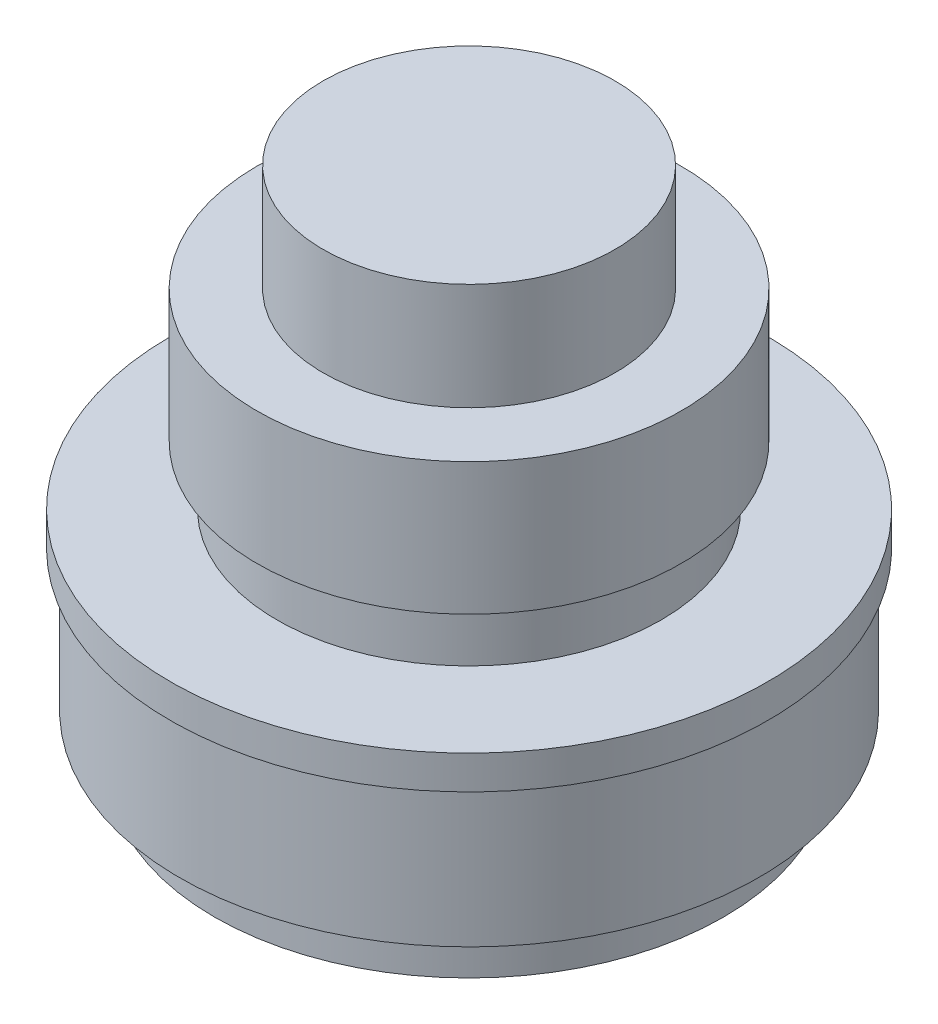
ISO-10303-21;
HEADER;
FILE_DESCRIPTION(('STEP AP214'),'2;1');
FILE_NAME('part.step','',(''),(''),'','','');
FILE_SCHEMA(('AUTOMOTIVE_DESIGN { 1 0 10303 214 1 1 1 1 }'));
ENDSEC;
DATA;
#1=APPLICATION_CONTEXT('core data for automotive mechanical design processes');
#2=APPLICATION_PROTOCOL_DEFINITION('international standard','automotive_design',2000,#1);
#3=PRODUCT_CONTEXT('',#1,'mechanical');
#4=PRODUCT('Part','Part','',(#3));
#5=PRODUCT_RELATED_PRODUCT_CATEGORY('part','',(#4));
#6=PRODUCT_DEFINITION_FORMATION('','',#4);
#7=PRODUCT_DEFINITION_CONTEXT('part definition',#1,'design');
#8=PRODUCT_DEFINITION('design','',#6,#7);
#9=PRODUCT_DEFINITION_SHAPE('','',#8);
#10=(LENGTH_UNIT() NAMED_UNIT(*) SI_UNIT(.MILLI.,.METRE.));
#11=(NAMED_UNIT(*) PLANE_ANGLE_UNIT() SI_UNIT($,.RADIAN.));
#12=(NAMED_UNIT(*) SI_UNIT($,.STERADIAN.) SOLID_ANGLE_UNIT());
#13=UNCERTAINTY_MEASURE_WITH_UNIT(LENGTH_MEASURE(1.E-05),#10,'distance_accuracy_value','');
#14=(GEOMETRIC_REPRESENTATION_CONTEXT(3) GLOBAL_UNCERTAINTY_ASSIGNED_CONTEXT((#13)) GLOBAL_UNIT_ASSIGNED_CONTEXT((#10,
#11,#12)) REPRESENTATION_CONTEXT('',''));
#15=CARTESIAN_POINT('',(0.,0.,0.));
#16=DIRECTION('',(0.,0.,1.));
#17=DIRECTION('',(1.,0.,0.));
#18=AXIS2_PLACEMENT_3D('',#15,#16,#17);
#19=CARTESIAN_POINT('',(0.,5.66216705587428,0.));
#20=DIRECTION('',(0.,1.,0.));
#21=DIRECTION('',(-1.,0.,0.));
#22=AXIS2_PLACEMENT_3D('',#19,#20,#21);
#23=PLANE('',#22);
#24=CARTESIAN_POINT('',(0.,5.66216705587428,0.));
#25=DIRECTION('',(0.,1.,0.));
#26=DIRECTION('',(-1.,0.,0.));
#27=AXIS2_PLACEMENT_3D('',#24,#25,#26);
#28=CIRCLE('',#27,12.71);
#29=CARTESIAN_POINT('',(-12.71,5.66216705587428,0.));
#30=VERTEX_POINT('',#29);
#31=EDGE_CURVE('E10',#30,#30,#28,.T.);
#32=ORIENTED_EDGE('',*,*,#31,.T.);
#33=EDGE_LOOP('',(#32));
#34=FACE_BOUND('',#33,.T.);
#35=ADVANCED_FACE('F41',(#34),#23,.T.);
#36=CARTESIAN_POINT('',(0.,5.66216705587428,0.));
#37=DIRECTION('',(0.,1.,0.));
#38=DIRECTION('',(-1.,0.,0.));
#39=AXIS2_PLACEMENT_3D('',#36,#37,#38);
#40=CYLINDRICAL_SURFACE('',#39,12.71);
#41=CARTESIAN_POINT('',(0.,-3.63783294412572,0.));
#42=DIRECTION('',(0.,1.,0.));
#43=DIRECTION('',(-1.,0.,0.));
#44=AXIS2_PLACEMENT_3D('',#41,#42,#43);
#45=CIRCLE('',#44,12.71);
#46=CARTESIAN_POINT('',(-12.71,-3.63783294412572,0.));
#47=VERTEX_POINT('',#46);
#48=EDGE_CURVE('E47',#47,#47,#45,.T.);
#49=ORIENTED_EDGE('',*,*,#48,.T.);
#50=EDGE_LOOP('',(#49));
#51=FACE_BOUND('',#50,.T.);
#52=ORIENTED_EDGE('',*,*,#31,.F.);
#53=EDGE_LOOP('',(#52));
#54=FACE_BOUND('',#53,.T.);
#55=ADVANCED_FACE('F97',(#51,#54),#40,.T.);
#56=CARTESIAN_POINT('',(-12.71,-3.63783294412572,0.));
#57=DIRECTION('',(0.,1.,0.));
#58=DIRECTION('',(-1.,0.,0.));
#59=AXIS2_PLACEMENT_3D('',#56,#57,#58);
#60=PLANE('',#59);
#61=CARTESIAN_POINT('',(0.,-3.63783294412572,0.));
#62=DIRECTION('',(0.,1.,0.));
#63=DIRECTION('',(-1.,0.,0.));
#64=AXIS2_PLACEMENT_3D('',#61,#62,#63);
#65=CIRCLE('',#64,18.46);
#66=CARTESIAN_POINT('',(-18.46,-3.63783294412572,0.));
#67=VERTEX_POINT('',#66);
#68=EDGE_CURVE('E51',#67,#67,#65,.T.);
#69=ORIENTED_EDGE('',*,*,#68,.T.);
#70=EDGE_LOOP('',(#69));
#71=FACE_BOUND('',#70,.T.);
#72=ORIENTED_EDGE('',*,*,#48,.F.);
#73=EDGE_LOOP('',(#72));
#74=FACE_BOUND('',#73,.T.);
#75=ADVANCED_FACE('F101',(#71,#74),#60,.T.);
#76=CARTESIAN_POINT('',(0.,5.66216705587428,0.));
#77=DIRECTION('',(0.,1.,0.));
#78=DIRECTION('',(-1.,0.,0.));
#79=AXIS2_PLACEMENT_3D('',#76,#77,#78);
#80=CYLINDRICAL_SURFACE('',#79,18.46);
#81=CARTESIAN_POINT('',(0.,-15.1378329441257,0.));
#82=DIRECTION('',(0.,1.,0.));
#83=DIRECTION('',(-1.,0.,0.));
#84=AXIS2_PLACEMENT_3D('',#81,#82,#83);
#85=CIRCLE('',#84,18.46);
#86=CARTESIAN_POINT('',(-18.46,-15.1378329441257,0.));
#87=VERTEX_POINT('',#86);
#88=EDGE_CURVE('E55',#87,#87,#85,.T.);
#89=ORIENTED_EDGE('',*,*,#88,.T.);
#90=EDGE_LOOP('',(#89));
#91=FACE_BOUND('',#90,.T.);
#92=ORIENTED_EDGE('',*,*,#68,.F.);
#93=EDGE_LOOP('',(#92));
#94=FACE_BOUND('',#93,.T.);
#95=ADVANCED_FACE('F105',(#91,#94),#80,.T.);
#96=CARTESIAN_POINT('',(-18.46,-15.1378329441257,0.));
#97=DIRECTION('',(0.,-1.,0.));
#98=DIRECTION('',(1.,0.,0.));
#99=AXIS2_PLACEMENT_3D('',#96,#97,#98);
#100=PLANE('',#99);
#101=CARTESIAN_POINT('',(0.,-15.1378329441257,0.));
#102=DIRECTION('',(0.,1.,0.));
#103=DIRECTION('',(-1.,0.,0.));
#104=AXIS2_PLACEMENT_3D('',#101,#102,#103);
#105=CIRCLE('',#104,16.715);
#106=CARTESIAN_POINT('',(-16.715,-15.1378329441257,0.));
#107=VERTEX_POINT('',#106);
#108=EDGE_CURVE('E60',#107,#107,#105,.T.);
#109=ORIENTED_EDGE('',*,*,#108,.T.);
#110=EDGE_LOOP('',(#109));
#111=FACE_BOUND('',#110,.T.);
#112=ORIENTED_EDGE('',*,*,#88,.F.);
#113=EDGE_LOOP('',(#112));
#114=FACE_BOUND('',#113,.T.);
#115=ADVANCED_FACE('F112',(#111,#114),#100,.T.);
#116=CARTESIAN_POINT('',(0.,5.66216705587428,0.));
#117=DIRECTION('',(0.,1.,0.));
#118=DIRECTION('',(-1.,0.,0.));
#119=AXIS2_PLACEMENT_3D('',#116,#117,#118);
#120=CYLINDRICAL_SURFACE('',#119,16.715);
#121=CARTESIAN_POINT('',(0.,-20.2678329441257,0.));
#122=DIRECTION('',(0.,1.,0.));
#123=DIRECTION('',(-1.,0.,0.));
#124=AXIS2_PLACEMENT_3D('',#121,#122,#123);
#125=CIRCLE('',#124,16.715);
#126=CARTESIAN_POINT('',(-16.715,-20.2678329441257,0.));
#127=VERTEX_POINT('',#126);
#128=EDGE_CURVE('E63',#127,#127,#125,.T.);
#129=ORIENTED_EDGE('',*,*,#128,.T.);
#130=EDGE_LOOP('',(#129));
#131=FACE_BOUND('',#130,.T.);
#132=ORIENTED_EDGE('',*,*,#108,.F.);
#133=EDGE_LOOP('',(#132));
#134=FACE_BOUND('',#133,.T.);
#135=ADVANCED_FACE('F116',(#131,#134),#120,.T.);
#136=CARTESIAN_POINT('',(-16.715,-20.2678329441257,0.));
#137=DIRECTION('',(0.,1.,0.));
#138=DIRECTION('',(-1.,0.,0.));
#139=AXIS2_PLACEMENT_3D('',#136,#137,#138);
#140=PLANE('',#139);
#141=CARTESIAN_POINT('',(0.,-20.2678329441257,0.));
#142=DIRECTION('',(0.,1.,0.));
#143=DIRECTION('',(-1.,0.,0.));
#144=AXIS2_PLACEMENT_3D('',#141,#142,#143);
#145=CIRCLE('',#144,26.005);
#146=CARTESIAN_POINT('',(-26.005,-20.2678329441257,0.));
#147=VERTEX_POINT('',#146);
#148=EDGE_CURVE('E66',#147,#147,#145,.T.);
#149=ORIENTED_EDGE('',*,*,#148,.T.);
#150=EDGE_LOOP('',(#149));
#151=FACE_BOUND('',#150,.T.);
#152=ORIENTED_EDGE('',*,*,#128,.F.);
#153=EDGE_LOOP('',(#152));
#154=FACE_BOUND('',#153,.T.);
#155=ADVANCED_FACE('F120',(#151,#154),#140,.T.);
#156=CARTESIAN_POINT('',(0.,5.66216705587428,0.));
#157=DIRECTION('',(0.,1.,0.));
#158=DIRECTION('',(-1.,0.,0.));
#159=AXIS2_PLACEMENT_3D('',#156,#157,#158);
#160=CYLINDRICAL_SURFACE('',#159,26.005);
#161=CARTESIAN_POINT('',(0.,-23.1935180292254,0.));
#162=DIRECTION('',(0.,1.,0.));
#163=DIRECTION('',(-1.,0.,0.));
#164=AXIS2_PLACEMENT_3D('',#161,#162,#163);
#165=CIRCLE('',#164,26.005);
#166=CARTESIAN_POINT('',(-26.005,-23.1935180292254,0.));
#167=VERTEX_POINT('',#166);
#168=EDGE_CURVE('E69',#167,#167,#165,.T.);
#169=ORIENTED_EDGE('',*,*,#168,.T.);
#170=EDGE_LOOP('',(#169));
#171=FACE_BOUND('',#170,.T.);
#172=ORIENTED_EDGE('',*,*,#148,.F.);
#173=EDGE_LOOP('',(#172));
#174=FACE_BOUND('',#173,.T.);
#175=ADVANCED_FACE('F124',(#171,#174),#160,.T.);
#176=CARTESIAN_POINT('',(-26.005,-23.1935180292254,0.));
#177=DIRECTION('',(0.,-1.,0.));
#178=DIRECTION('',(1.,0.,0.));
#179=AXIS2_PLACEMENT_3D('',#176,#177,#178);
#180=PLANE('',#179);
#181=CARTESIAN_POINT('',(0.,-23.1935180292254,0.));
#182=DIRECTION('',(0.,1.,0.));
#183=DIRECTION('',(-1.,0.,0.));
#184=AXIS2_PLACEMENT_3D('',#181,#182,#183);
#185=CIRCLE('',#184,25.2);
#186=CARTESIAN_POINT('',(-25.2,-23.1935180292254,0.));
#187=VERTEX_POINT('',#186);
#188=EDGE_CURVE('E72',#187,#187,#185,.T.);
#189=ORIENTED_EDGE('',*,*,#188,.T.);
#190=EDGE_LOOP('',(#189));
#191=FACE_BOUND('',#190,.T.);
#192=ORIENTED_EDGE('',*,*,#168,.F.);
#193=EDGE_LOOP('',(#192));
#194=FACE_BOUND('',#193,.T.);
#195=ADVANCED_FACE('F128',(#191,#194),#180,.T.);
#196=CARTESIAN_POINT('',(0.,5.66216705587428,0.));
#197=DIRECTION('',(0.,1.,0.));
#198=DIRECTION('',(-1.,0.,0.));
#199=AXIS2_PLACEMENT_3D('',#196,#197,#198);
#200=CYLINDRICAL_SURFACE('',#199,25.2);
#201=CARTESIAN_POINT('',(0.,-35.4435180292254,0.));
#202=DIRECTION('',(0.,1.,0.));
#203=DIRECTION('',(-1.,0.,0.));
#204=AXIS2_PLACEMENT_3D('',#201,#202,#203);
#205=CIRCLE('',#204,25.2);
#206=CARTESIAN_POINT('',(-25.2,-35.4435180292254,0.));
#207=VERTEX_POINT('',#206);
#208=EDGE_CURVE('E75',#207,#207,#205,.T.);
#209=ORIENTED_EDGE('',*,*,#208,.T.);
#210=EDGE_LOOP('',(#209));
#211=FACE_BOUND('',#210,.T.);
#212=ORIENTED_EDGE('',*,*,#188,.F.);
#213=EDGE_LOOP('',(#212));
#214=FACE_BOUND('',#213,.T.);
#215=ADVANCED_FACE('F132',(#211,#214),#200,.T.);
#216=CARTESIAN_POINT('',(-25.2,-35.4435180292254,0.));
#217=DIRECTION('',(0.,-1.,0.));
#218=DIRECTION('',(1.,0.,0.));
#219=AXIS2_PLACEMENT_3D('',#216,#217,#218);
#220=PLANE('',#219);
#221=CARTESIAN_POINT('',(0.,-35.4435180292254,0.));
#222=DIRECTION('',(0.,1.,0.));
#223=DIRECTION('',(-1.,0.,0.));
#224=AXIS2_PLACEMENT_3D('',#221,#222,#223);
#225=CIRCLE('',#224,22.155);
#226=CARTESIAN_POINT('',(-22.155,-35.4435180292254,0.));
#227=VERTEX_POINT('',#226);
#228=EDGE_CURVE('E78',#227,#227,#225,.T.);
#229=ORIENTED_EDGE('',*,*,#228,.T.);
#230=EDGE_LOOP('',(#229));
#231=FACE_BOUND('',#230,.T.);
#232=ORIENTED_EDGE('',*,*,#208,.F.);
#233=EDGE_LOOP('',(#232));
#234=FACE_BOUND('',#233,.T.);
#235=ADVANCED_FACE('F94',(#231,#234),#220,.T.);
#236=CARTESIAN_POINT('',(0.,5.66216705587428,0.));
#237=DIRECTION('',(0.,1.,0.));
#238=DIRECTION('',(-1.,0.,0.));
#239=AXIS2_PLACEMENT_3D('',#236,#237,#238);
#240=CYLINDRICAL_SURFACE('',#239,22.155);
#241=CARTESIAN_POINT('',(0.,-39.9378329441257,0.));
#242=DIRECTION('',(0.,1.,0.));
#243=DIRECTION('',(-1.,0.,0.));
#244=AXIS2_PLACEMENT_3D('',#241,#242,#243);
#245=CIRCLE('',#244,22.155);
#246=CARTESIAN_POINT('',(-22.155,-39.9378329441257,0.));
#247=VERTEX_POINT('',#246);
#248=EDGE_CURVE('E81',#247,#247,#245,.T.);
#249=ORIENTED_EDGE('',*,*,#248,.T.);
#250=EDGE_LOOP('',(#249));
#251=FACE_BOUND('',#250,.T.);
#252=ORIENTED_EDGE('',*,*,#228,.F.);
#253=EDGE_LOOP('',(#252));
#254=FACE_BOUND('',#253,.T.);
#255=ADVANCED_FACE('F85',(#251,#254),#240,.T.);
#256=CARTESIAN_POINT('',(-22.155,-39.9378329441257,0.));
#257=DIRECTION('',(0.,-1.,0.));
#258=DIRECTION('',(1.,0.,0.));
#259=AXIS2_PLACEMENT_3D('',#256,#257,#258);
#260=PLANE('',#259);
#261=ORIENTED_EDGE('',*,*,#248,.F.);
#262=EDGE_LOOP('',(#261));
#263=FACE_BOUND('',#262,.T.);
#264=ADVANCED_FACE('F88',(#263),#260,.T.);
#265=CLOSED_SHELL('',(#35,#55,#75,#95,#115,#135,#155,#175,#195,#215,#235,#255,#264));
#266=MANIFOLD_SOLID_BREP('B2',#265);
#267=ADVANCED_BREP_SHAPE_REPRESENTATION('',(#18,#266),#14);
#268=SHAPE_DEFINITION_REPRESENTATION(#9,#267);
ENDSEC;
END-ISO-10303-21;
